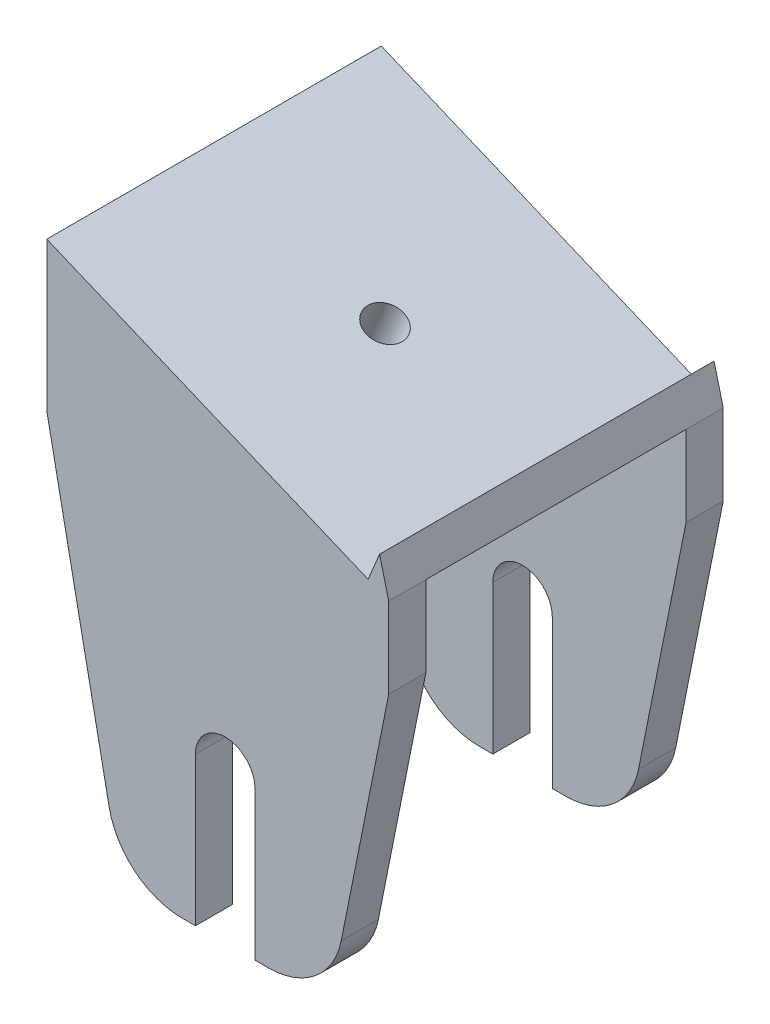
ISO-10303-21;
HEADER;
FILE_DESCRIPTION(('STEP AP214'),'2;1');
FILE_NAME('part.step','',(''),(''),'','','');
FILE_SCHEMA(('AUTOMOTIVE_DESIGN { 1 0 10303 214 1 1 1 1 }'));
ENDSEC;
DATA;
#1=APPLICATION_CONTEXT('core data for automotive mechanical design processes');
#2=APPLICATION_PROTOCOL_DEFINITION('international standard','automotive_design',2000,#1);
#3=PRODUCT_CONTEXT('',#1,'mechanical');
#4=PRODUCT('Part','Part','',(#3));
#5=PRODUCT_RELATED_PRODUCT_CATEGORY('part','',(#4));
#6=PRODUCT_DEFINITION_FORMATION('','',#4);
#7=PRODUCT_DEFINITION_CONTEXT('part definition',#1,'design');
#8=PRODUCT_DEFINITION('design','',#6,#7);
#9=PRODUCT_DEFINITION_SHAPE('','',#8);
#10=(LENGTH_UNIT() NAMED_UNIT(*) SI_UNIT(.MILLI.,.METRE.));
#11=(NAMED_UNIT(*) PLANE_ANGLE_UNIT() SI_UNIT($,.RADIAN.));
#12=(NAMED_UNIT(*) SI_UNIT($,.STERADIAN.) SOLID_ANGLE_UNIT());
#13=UNCERTAINTY_MEASURE_WITH_UNIT(LENGTH_MEASURE(1.E-05),#10,'distance_accuracy_value','');
#14=(GEOMETRIC_REPRESENTATION_CONTEXT(3) GLOBAL_UNCERTAINTY_ASSIGNED_CONTEXT((#13)) GLOBAL_UNIT_ASSIGNED_CONTEXT((#10,
#11,#12)) REPRESENTATION_CONTEXT('',''));
#15=CARTESIAN_POINT('',(0.,0.,0.));
#16=DIRECTION('',(0.,0.,1.));
#17=DIRECTION('',(1.,0.,0.));
#18=AXIS2_PLACEMENT_3D('',#15,#16,#17);
#19=CARTESIAN_POINT('',(3.16987234543207,7.45293193717279,-5.00010000000001));
#20=DIRECTION('',(-1.,0.,0.));
#21=DIRECTION('',(0.,0.,1.));
#22=AXIS2_PLACEMENT_3D('',#19,#20,#21);
#23=PLANE('',#22);
#24=DIRECTION('',(0.,-1.,0.));
#25=VECTOR('',#24,1.);
#26=CARTESIAN_POINT('',(3.16987234543207,7.45293193717279,40.));
#27=LINE('',#26,#25);
#28=CARTESIAN_POINT('',(3.16987234543207,18.2863736038394,40.));
#29=VERTEX_POINT('',#28);
#30=CARTESIAN_POINT('',(3.16987234543207,7.45293193717279,40.));
#31=VERTEX_POINT('',#30);
#32=EDGE_CURVE('E263',#29,#31,#27,.T.);
#33=ORIENTED_EDGE('',*,*,#32,.F.);
#34=DIRECTION('',(0.,0.,-1.));
#35=VECTOR('',#34,1.);
#36=CARTESIAN_POINT('',(3.16987234543207,18.2863736038394,0.));
#37=LINE('',#36,#35);
#38=CARTESIAN_POINT('',(3.16987234543207,18.2863736038394,45.));
#39=VERTEX_POINT('',#38);
#40=EDGE_CURVE('E283',#39,#29,#37,.T.);
#41=ORIENTED_EDGE('',*,*,#40,.F.);
#42=DIRECTION('',(0.,-1.,0.));
#43=VECTOR('',#42,1.);
#44=CARTESIAN_POINT('',(3.16987234543207,7.45293193717279,45.));
#45=LINE('',#44,#43);
#46=CARTESIAN_POINT('',(3.16987234543207,7.45293193717279,45.));
#47=VERTEX_POINT('',#46);
#48=EDGE_CURVE('E279',#39,#47,#45,.T.);
#49=ORIENTED_EDGE('',*,*,#48,.T.);
#50=DIRECTION('',(0.,0.,1.));
#51=VECTOR('',#50,1.);
#52=CARTESIAN_POINT('',(3.16987234543207,7.45293193717278,45.));
#53=LINE('',#52,#51);
#54=EDGE_CURVE('E299',#31,#47,#53,.T.);
#55=ORIENTED_EDGE('',*,*,#54,.F.);
#56=EDGE_LOOP('',(#33,#41,#49,#55));
#57=FACE_BOUND('',#56,.T.);
#58=ADVANCED_FACE('F33',(#57),#23,.F.);
#59=CARTESIAN_POINT('',(-24.6320886273824,-22.5470680628272,45.));
#60=DIRECTION('',(0.,0.,-1.));
#61=DIRECTION('',(-1.,0.,0.));
#62=AXIS2_PLACEMENT_3D('',#59,#60,#61);
#63=CYLINDRICAL_SURFACE('',#62,10.);
#64=CARTESIAN_POINT('',(-24.6320886273824,-22.5470680628272,40.));
#65=DIRECTION('',(0.,0.,-1.));
#66=DIRECTION('',(-1.,0.,0.));
#67=AXIS2_PLACEMENT_3D('',#64,#65,#66);
#68=CIRCLE('',#67,10.);
#69=CARTESIAN_POINT('',(-24.6320886273823,-32.5470680628272,40.));
#70=VERTEX_POINT('',#69);
#71=CARTESIAN_POINT('',(-34.4378953842916,-24.508229414209,40.));
#72=VERTEX_POINT('',#71);
#73=EDGE_CURVE('E319',#70,#72,#68,.T.);
#74=ORIENTED_EDGE('',*,*,#73,.F.);
#75=DIRECTION('',(0.,0.,-1.));
#76=VECTOR('',#75,1.);
#77=CARTESIAN_POINT('',(-24.6320886273823,-32.5470680628272,45.));
#78=LINE('',#77,#76);
#79=CARTESIAN_POINT('',(-24.6320886273823,-32.5470680628272,45.));
#80=VERTEX_POINT('',#79);
#81=EDGE_CURVE('E430',#80,#70,#78,.T.);
#82=ORIENTED_EDGE('',*,*,#81,.F.);
#83=CARTESIAN_POINT('',(-24.6320886273824,-22.5470680628272,45.));
#84=DIRECTION('',(0.,0.,1.));
#85=DIRECTION('',(1.,0.,0.));
#86=AXIS2_PLACEMENT_3D('',#83,#84,#85);
#87=CIRCLE('',#86,10.);
#88=CARTESIAN_POINT('',(-34.4378953842916,-24.508229414209,45.));
#89=VERTEX_POINT('',#88);
#90=EDGE_CURVE('E347',#89,#80,#87,.T.);
#91=ORIENTED_EDGE('',*,*,#90,.F.);
#92=DIRECTION('',(0.,0.,-1.));
#93=VECTOR('',#92,1.);
#94=CARTESIAN_POINT('',(-34.4378953842916,-24.508229414209,45.));
#95=LINE('',#94,#93);
#96=EDGE_CURVE('E398',#89,#72,#95,.T.);
#97=ORIENTED_EDGE('',*,*,#96,.T.);
#98=EDGE_LOOP('',(#74,#82,#91,#97));
#99=FACE_BOUND('',#98,.T.);
#100=ADVANCED_FACE('F502',(#99),#63,.T.);
#101=CARTESIAN_POINT('',(-22.8301276545679,-32.5470680628272,45.));
#102=DIRECTION('',(0.,1.,0.));
#103=DIRECTION('',(0.,0.,1.));
#104=AXIS2_PLACEMENT_3D('',#101,#102,#103);
#105=PLANE('',#104);
#106=DIRECTION('',(-1.,0.,0.));
#107=VECTOR('',#106,1.);
#108=CARTESIAN_POINT('',(12.1698723454321,-32.5470680628272,40.));
#109=LINE('',#108,#107);
#110=CARTESIAN_POINT('',(-22.8301276545679,-32.5470680628272,40.));
#111=VERTEX_POINT('',#110);
#112=EDGE_CURVE('E313',#111,#70,#109,.T.);
#113=ORIENTED_EDGE('',*,*,#112,.F.);
#114=DIRECTION('',(0.,0.,-1.));
#115=VECTOR('',#114,1.);
#116=CARTESIAN_POINT('',(-22.8301276545679,-32.5470680628272,45.));
#117=LINE('',#116,#115);
#118=CARTESIAN_POINT('',(-22.8301276545679,-32.5470680628272,45.));
#119=VERTEX_POINT('',#118);
#120=EDGE_CURVE('E426',#119,#111,#117,.T.);
#121=ORIENTED_EDGE('',*,*,#120,.F.);
#122=DIRECTION('',(1.,0.,0.));
#123=VECTOR('',#122,1.);
#124=CARTESIAN_POINT('',(-22.8301276545679,-32.5470680628272,45.));
#125=LINE('',#124,#123);
#126=EDGE_CURVE('E350',#80,#119,#125,.T.);
#127=ORIENTED_EDGE('',*,*,#126,.F.);
#128=ORIENTED_EDGE('',*,*,#81,.T.);
#129=EDGE_LOOP('',(#113,#121,#127,#128));
#130=FACE_BOUND('',#129,.T.);
#131=ADVANCED_FACE('F497',(#130),#105,.F.);
#132=CARTESIAN_POINT('',(-22.8301276545679,-12.5470680628272,45.));
#133=DIRECTION('',(-1.,0.,0.));
#134=DIRECTION('',(0.,-1.,0.));
#135=AXIS2_PLACEMENT_3D('',#132,#133,#134);
#136=PLANE('',#135);
#137=DIRECTION('',(0.,-1.,0.));
#138=VECTOR('',#137,1.);
#139=CARTESIAN_POINT('',(-22.8301276545679,-12.5470680628272,40.));
#140=LINE('',#139,#138);
#141=CARTESIAN_POINT('',(-22.8301276545679,-12.5470680628272,40.));
#142=VERTEX_POINT('',#141);
#143=EDGE_CURVE('E329',#142,#111,#140,.T.);
#144=ORIENTED_EDGE('',*,*,#143,.F.);
#145=DIRECTION('',(0.,0.,-1.));
#146=VECTOR('',#145,1.);
#147=CARTESIAN_POINT('',(-22.8301276545679,-12.5470680628272,45.));
#148=LINE('',#147,#146);
#149=CARTESIAN_POINT('',(-22.8301276545679,-12.5470680628272,45.));
#150=VERTEX_POINT('',#149);
#151=EDGE_CURVE('E422',#150,#142,#148,.T.);
#152=ORIENTED_EDGE('',*,*,#151,.F.);
#153=DIRECTION('',(0.,1.,0.));
#154=VECTOR('',#153,1.);
#155=CARTESIAN_POINT('',(-22.8301276545679,-12.5470680628272,45.));
#156=LINE('',#155,#154);
#157=EDGE_CURVE('E353',#119,#150,#156,.T.);
#158=ORIENTED_EDGE('',*,*,#157,.F.);
#159=ORIENTED_EDGE('',*,*,#120,.T.);
#160=EDGE_LOOP('',(#144,#152,#158,#159));
#161=FACE_BOUND('',#160,.T.);
#162=ADVANCED_FACE('F493',(#161),#136,.F.);
#163=CARTESIAN_POINT('',(-18.8301276545679,-12.5470680628272,45.));
#164=DIRECTION('',(0.,0.,-1.));
#165=DIRECTION('',(-1.,0.,0.));
#166=AXIS2_PLACEMENT_3D('',#163,#164,#165);
#167=CYLINDRICAL_SURFACE('',#166,4.);
#168=CARTESIAN_POINT('',(-18.8301276545679,-12.5470680628272,40.));
#169=DIRECTION('',(0.,0.,-1.));
#170=DIRECTION('',(-1.,0.,0.));
#171=AXIS2_PLACEMENT_3D('',#168,#169,#170);
#172=CIRCLE('',#171,4.);
#173=CARTESIAN_POINT('',(-14.8301276545679,-12.5470680628272,40.));
#174=VERTEX_POINT('',#173);
#175=EDGE_CURVE('E327',#174,#142,#172,.F.);
#176=ORIENTED_EDGE('',*,*,#175,.F.);
#177=DIRECTION('',(0.,0.,-1.));
#178=VECTOR('',#177,1.);
#179=CARTESIAN_POINT('',(-14.8301276545679,-12.5470680628272,45.));
#180=LINE('',#179,#178);
#181=CARTESIAN_POINT('',(-14.8301276545679,-12.5470680628272,45.));
#182=VERTEX_POINT('',#181);
#183=EDGE_CURVE('E418',#182,#174,#180,.T.);
#184=ORIENTED_EDGE('',*,*,#183,.F.);
#185=CARTESIAN_POINT('',(-18.8301276545679,-12.5470680628272,45.));
#186=DIRECTION('',(0.,0.,-1.));
#187=DIRECTION('',(1.,0.,0.));
#188=AXIS2_PLACEMENT_3D('',#185,#186,#187);
#189=CIRCLE('',#188,4.);
#190=EDGE_CURVE('E355',#150,#182,#189,.T.);
#191=ORIENTED_EDGE('',*,*,#190,.F.);
#192=ORIENTED_EDGE('',*,*,#151,.T.);
#193=EDGE_LOOP('',(#176,#184,#191,#192));
#194=FACE_BOUND('',#193,.T.);
#195=ADVANCED_FACE('F488',(#194),#167,.F.);
#196=CARTESIAN_POINT('',(-14.8301276545679,-12.5470680628272,45.));
#197=DIRECTION('',(1.,0.,0.));
#198=DIRECTION('',(0.,1.,0.));
#199=AXIS2_PLACEMENT_3D('',#196,#197,#198);
#200=PLANE('',#199);
#201=DIRECTION('',(0.,1.,0.));
#202=VECTOR('',#201,1.);
#203=CARTESIAN_POINT('',(-14.8301276545679,-12.5470680628272,40.));
#204=LINE('',#203,#202);
#205=CARTESIAN_POINT('',(-14.8301276545679,-32.5470680628272,40.));
#206=VERTEX_POINT('',#205);
#207=EDGE_CURVE('E325',#206,#174,#204,.T.);
#208=ORIENTED_EDGE('',*,*,#207,.F.);
#209=DIRECTION('',(0.,0.,-1.));
#210=VECTOR('',#209,1.);
#211=CARTESIAN_POINT('',(-14.8301276545679,-32.5470680628272,45.));
#212=LINE('',#211,#210);
#213=CARTESIAN_POINT('',(-14.8301276545679,-32.5470680628272,45.));
#214=VERTEX_POINT('',#213);
#215=EDGE_CURVE('E414',#214,#206,#212,.T.);
#216=ORIENTED_EDGE('',*,*,#215,.F.);
#217=DIRECTION('',(0.,-1.,0.));
#218=VECTOR('',#217,1.);
#219=CARTESIAN_POINT('',(-14.8301276545679,-12.5470680628272,45.));
#220=LINE('',#219,#218);
#221=EDGE_CURVE('E357',#182,#214,#220,.T.);
#222=ORIENTED_EDGE('',*,*,#221,.F.);
#223=ORIENTED_EDGE('',*,*,#183,.T.);
#224=EDGE_LOOP('',(#208,#216,#222,#223));
#225=FACE_BOUND('',#224,.T.);
#226=ADVANCED_FACE('F483',(#225),#200,.F.);
#227=CARTESIAN_POINT('',(-14.8301276545679,-32.5470680628272,45.));
#228=DIRECTION('',(0.,1.,0.));
#229=DIRECTION('',(0.,0.,1.));
#230=AXIS2_PLACEMENT_3D('',#227,#228,#229);
#231=PLANE('',#230);
#232=CARTESIAN_POINT('',(-13.0281666817535,-32.5470680628272,40.));
#233=VERTEX_POINT('',#232);
#234=EDGE_CURVE('E315',#233,#206,#109,.T.);
#235=ORIENTED_EDGE('',*,*,#234,.F.);
#236=DIRECTION('',(0.,0.,-1.));
#237=VECTOR('',#236,1.);
#238=CARTESIAN_POINT('',(-13.0281666817535,-32.5470680628272,45.));
#239=LINE('',#238,#237);
#240=CARTESIAN_POINT('',(-13.0281666817535,-32.5470680628272,45.));
#241=VERTEX_POINT('',#240);
#242=EDGE_CURVE('E410',#241,#233,#239,.T.);
#243=ORIENTED_EDGE('',*,*,#242,.F.);
#244=DIRECTION('',(1.,0.,0.));
#245=VECTOR('',#244,1.);
#246=CARTESIAN_POINT('',(-14.8301276545679,-32.5470680628272,45.));
#247=LINE('',#246,#245);
#248=EDGE_CURVE('E359',#214,#241,#247,.T.);
#249=ORIENTED_EDGE('',*,*,#248,.F.);
#250=ORIENTED_EDGE('',*,*,#215,.T.);
#251=EDGE_LOOP('',(#235,#243,#249,#250));
#252=FACE_BOUND('',#251,.T.);
#253=ADVANCED_FACE('F478',(#252),#231,.F.);
#254=CARTESIAN_POINT('',(-13.0281666817535,-22.5470680628272,45.));
#255=DIRECTION('',(0.,0.,-1.));
#256=DIRECTION('',(-1.,0.,0.));
#257=AXIS2_PLACEMENT_3D('',#254,#255,#256);
#258=CYLINDRICAL_SURFACE('',#257,10.);
#259=CARTESIAN_POINT('',(-13.0281666817535,-22.5470680628272,40.));
#260=DIRECTION('',(0.,0.,-1.));
#261=DIRECTION('',(-1.,0.,0.));
#262=AXIS2_PLACEMENT_3D('',#259,#260,#261);
#263=CIRCLE('',#262,10.);
#264=CARTESIAN_POINT('',(-3.22235992484428,-24.508229414209,40.));
#265=VERTEX_POINT('',#264);
#266=EDGE_CURVE('E323',#265,#233,#263,.T.);
#267=ORIENTED_EDGE('',*,*,#266,.F.);
#268=DIRECTION('',(0.,0.,-1.));
#269=VECTOR('',#268,1.);
#270=CARTESIAN_POINT('',(-3.22235992484428,-24.508229414209,45.));
#271=LINE('',#270,#269);
#272=CARTESIAN_POINT('',(-3.22235992484428,-24.508229414209,45.));
#273=VERTEX_POINT('',#272);
#274=EDGE_CURVE('E406',#273,#265,#271,.T.);
#275=ORIENTED_EDGE('',*,*,#274,.F.);
#276=CARTESIAN_POINT('',(-13.0281666817535,-22.5470680628272,45.));
#277=DIRECTION('',(0.,0.,1.));
#278=DIRECTION('',(-1.,0.,0.));
#279=AXIS2_PLACEMENT_3D('',#276,#277,#278);
#280=CIRCLE('',#279,10.);
#281=EDGE_CURVE('E361',#241,#273,#280,.T.);
#282=ORIENTED_EDGE('',*,*,#281,.F.);
#283=ORIENTED_EDGE('',*,*,#242,.T.);
#284=EDGE_LOOP('',(#267,#275,#282,#283));
#285=FACE_BOUND('',#284,.T.);
#286=ADVANCED_FACE('F474',(#285),#258,.T.);
#287=CARTESIAN_POINT('',(-3.22235992484428,-24.508229414209,45.));
#288=DIRECTION('',(-0.98058067569092,0.196116135138184,0.));
#289=DIRECTION('',(-0.196116135138184,-0.98058067569092,0.));
#290=AXIS2_PLACEMENT_3D('',#287,#288,#289);
#291=PLANE('',#290);
#292=DIRECTION('',(-0.196116135138184,-0.98058067569092,0.));
#293=VECTOR('',#292,1.);
#294=CARTESIAN_POINT('',(-3.22235992484428,-24.508229414209,40.));
#295=LINE('',#294,#293);
#296=EDGE_CURVE('E321',#31,#265,#295,.T.);
#297=ORIENTED_EDGE('',*,*,#296,.F.);
#298=ORIENTED_EDGE('',*,*,#54,.T.);
#299=DIRECTION('',(0.196116135138184,0.98058067569092,0.));
#300=VECTOR('',#299,1.);
#301=CARTESIAN_POINT('',(-3.22235992484428,-24.508229414209,45.));
#302=LINE('',#301,#300);
#303=EDGE_CURVE('E363',#273,#47,#302,.T.);
#304=ORIENTED_EDGE('',*,*,#303,.F.);
#305=ORIENTED_EDGE('',*,*,#274,.T.);
#306=EDGE_LOOP('',(#297,#298,#304,#305));
#307=FACE_BOUND('',#306,.T.);
#308=ADVANCED_FACE('F470',(#307),#291,.F.);
#309=CARTESIAN_POINT('',(-34.4378953842916,-24.508229414209,45.));
#310=DIRECTION('',(0.98058067569092,0.196116135138184,0.));
#311=DIRECTION('',(-0.196116135138184,0.98058067569092,0.));
#312=AXIS2_PLACEMENT_3D('',#309,#310,#311);
#313=PLANE('',#312);
#314=DIRECTION('',(-0.196116135138184,0.98058067569092,0.));
#315=VECTOR('',#314,1.);
#316=CARTESIAN_POINT('',(-34.4378953842916,-24.508229414209,40.));
#317=LINE('',#316,#315);
#318=CARTESIAN_POINT('',(-42.8301276545679,17.4529319371728,40.));
#319=VERTEX_POINT('',#318);
#320=EDGE_CURVE('E433',#72,#319,#317,.T.);
#321=ORIENTED_EDGE('',*,*,#320,.F.);
#322=ORIENTED_EDGE('',*,*,#96,.F.);
#323=DIRECTION('',(0.196116135138184,-0.98058067569092,0.));
#324=VECTOR('',#323,1.);
#325=CARTESIAN_POINT('',(-34.4378953842916,-24.508229414209,45.));
#326=LINE('',#325,#324);
#327=CARTESIAN_POINT('',(-42.8301276545679,17.4529319371728,45.));
#328=VERTEX_POINT('',#327);
#329=EDGE_CURVE('E368',#328,#89,#326,.T.);
#330=ORIENTED_EDGE('',*,*,#329,.F.);
#331=DIRECTION('',(0.,0.,-1.));
#332=VECTOR('',#331,1.);
#333=CARTESIAN_POINT('',(-42.8301276545679,17.4529319371728,45.));
#334=LINE('',#333,#332);
#335=EDGE_CURVE('E402',#328,#319,#334,.T.);
#336=ORIENTED_EDGE('',*,*,#335,.T.);
#337=EDGE_LOOP('',(#321,#322,#330,#336));
#338=FACE_BOUND('',#337,.T.);
#339=ADVANCED_FACE('F507',(#338),#313,.F.);
#340=CARTESIAN_POINT('',(-24.6320886273824,-22.5470680628272,45.));
#341=DIRECTION('',(0.,0.,1.));
#342=DIRECTION('',(1.,0.,0.));
#343=AXIS2_PLACEMENT_3D('',#340,#341,#342);
#344=PLANE('',#343);
#345=ORIENTED_EDGE('',*,*,#48,.F.);
#346=DIRECTION('',(-0.246153846153847,0.969230769230769,0.));
#347=VECTOR('',#346,1.);
#348=CARTESIAN_POINT('',(1.93910311466284,23.1325274499933,45.));
#349=LINE('',#348,#347);
#350=CARTESIAN_POINT('',(1.93910311466284,23.1325274499933,45.));
#351=VERTEX_POINT('',#350);
#352=EDGE_CURVE('E257',#39,#351,#349,.T.);
#353=ORIENTED_EDGE('',*,*,#352,.T.);
#354=DIRECTION('',(-0.384615384615384,-0.923076923076923,0.));
#355=VECTOR('',#354,1.);
#356=CARTESIAN_POINT('',(0.400641576201298,19.4402197576856,45.));
#357=LINE('',#356,#355);
#358=CARTESIAN_POINT('',(0.400641576201295,19.4402197576856,45.));
#359=VERTEX_POINT('',#358);
#360=EDGE_CURVE('E234',#351,#359,#357,.T.);
#361=ORIENTED_EDGE('',*,*,#360,.T.);
#362=DIRECTION('',(0.923076923076923,-0.384615384615385,0.));
#363=VECTOR('',#362,1.);
#364=CARTESIAN_POINT('',(5.16991080697052,17.4530242448651,45.));
#365=LINE('',#364,#363);
#366=CARTESIAN_POINT('',(-42.8300891930295,37.4530242448651,45.));
#367=VERTEX_POINT('',#366);
#368=EDGE_CURVE('E48',#367,#359,#365,.T.);
#369=ORIENTED_EDGE('',*,*,#368,.F.);
#370=DIRECTION('',(0.384615384615384,0.923076923076923,0.));
#371=VECTOR('',#370,1.);
#372=CARTESIAN_POINT('',(-46.6762815007218,28.2221627064035,45.));
#373=LINE('',#372,#371);
#374=CARTESIAN_POINT('',(-42.8301276545679,37.4529319371728,45.));
#375=VERTEX_POINT('',#374);
#376=EDGE_CURVE('E297',#375,#367,#373,.T.);
#377=ORIENTED_EDGE('',*,*,#376,.F.);
#378=DIRECTION('',(0.,-1.,0.));
#379=VECTOR('',#378,1.);
#380=CARTESIAN_POINT('',(-42.8301276545679,37.4529319371728,45.));
#381=LINE('',#380,#379);
#382=EDGE_CURVE('E366',#375,#328,#381,.T.);
#383=ORIENTED_EDGE('',*,*,#382,.T.);
#384=ORIENTED_EDGE('',*,*,#329,.T.);
#385=ORIENTED_EDGE('',*,*,#90,.T.);
#386=ORIENTED_EDGE('',*,*,#126,.T.);
#387=ORIENTED_EDGE('',*,*,#157,.T.);
#388=ORIENTED_EDGE('',*,*,#190,.T.);
#389=ORIENTED_EDGE('',*,*,#221,.T.);
#390=ORIENTED_EDGE('',*,*,#248,.T.);
#391=ORIENTED_EDGE('',*,*,#281,.T.);
#392=ORIENTED_EDGE('',*,*,#303,.T.);
#393=EDGE_LOOP('',(#345,#353,#361,#369,#377,#383,#384,#385,#386,#387,#388,#389,#390,#391,#392));
#394=FACE_BOUND('',#393,.T.);
#395=ADVANCED_FACE('F464',(#394),#344,.T.);
#396=CARTESIAN_POINT('',(12.1698723454321,27.3827956073122,40.));
#397=DIRECTION('',(0.,0.,-1.));
#398=DIRECTION('',(-1.,0.,0.));
#399=AXIS2_PLACEMENT_3D('',#396,#397,#398);
#400=PLANE('',#399);
#401=DIRECTION('',(-0.923076923076923,0.384615384615384,0.));
#402=VECTOR('',#401,1.);
#403=CARTESIAN_POINT('',(3.76282015485004,7.20587034991529,40.));
#404=LINE('',#403,#402);
#405=CARTESIAN_POINT('',(-8.83012765456794,12.4529319371728,40.));
#406=VERTEX_POINT('',#405);
#407=CARTESIAN_POINT('',(-42.8301276545679,26.6195986038394,40.));
#408=VERTEX_POINT('',#407);
#409=EDGE_CURVE('E437',#406,#408,#404,.T.);
#410=ORIENTED_EDGE('',*,*,#409,.F.);
#411=DIRECTION('',(1.,0.,0.));
#412=VECTOR('',#411,1.);
#413=CARTESIAN_POINT('',(-46.8301276545679,12.4529319371728,40.));
#414=LINE('',#413,#412);
#415=CARTESIAN_POINT('',(-6.83012765456793,12.4529319371728,40.));
#416=VERTEX_POINT('',#415);
#417=EDGE_CURVE('E266',#406,#416,#414,.T.);
#418=ORIENTED_EDGE('',*,*,#417,.T.);
#419=CARTESIAN_POINT('',(-6.83012765456793,22.4529319371728,40.));
#420=DIRECTION('',(0.,0.,-1.));
#421=DIRECTION('',(-1.,0.,0.));
#422=AXIS2_PLACEMENT_3D('',#419,#420,#421);
#423=CIRCLE('',#422,10.);
#424=CARTESIAN_POINT('',(2.40068003727822,18.6068703989035,40.));
#425=VERTEX_POINT('',#424);
#426=EDGE_CURVE('E41',#416,#425,#423,.F.);
#427=ORIENTED_EDGE('',*,*,#426,.T.);
#428=DIRECTION('',(-0.923076923076923,0.384615384615384,0.));
#429=VECTOR('',#428,1.);
#430=CARTESIAN_POINT('',(7.60901246254235,16.4367318883768,40.));
#431=LINE('',#430,#429);
#432=EDGE_CURVE('E448',#29,#425,#431,.T.);
#433=ORIENTED_EDGE('',*,*,#432,.F.);
#434=ORIENTED_EDGE('',*,*,#32,.T.);
#435=ORIENTED_EDGE('',*,*,#296,.T.);
#436=ORIENTED_EDGE('',*,*,#266,.T.);
#437=ORIENTED_EDGE('',*,*,#234,.T.);
#438=ORIENTED_EDGE('',*,*,#207,.T.);
#439=ORIENTED_EDGE('',*,*,#175,.T.);
#440=ORIENTED_EDGE('',*,*,#143,.T.);
#441=ORIENTED_EDGE('',*,*,#112,.T.);
#442=ORIENTED_EDGE('',*,*,#73,.T.);
#443=ORIENTED_EDGE('',*,*,#320,.T.);
#444=DIRECTION('',(0.,1.,0.));
#445=VECTOR('',#444,1.);
#446=CARTESIAN_POINT('',(-42.8301276545679,37.4529319371728,40.));
#447=LINE('',#446,#445);
#448=EDGE_CURVE('E316',#319,#408,#447,.T.);
#449=ORIENTED_EDGE('',*,*,#448,.T.);
#450=EDGE_LOOP('',(#410,#418,#427,#433,#434,#435,#436,#437,#438,#439,#440,#441,#442,#443,#449));
#451=FACE_BOUND('',#450,.T.);
#452=ADVANCED_FACE('F454',(#451),#400,.T.);
#453=CARTESIAN_POINT('',(-46.6762815007218,28.2221627064035,45.));
#454=DIRECTION('',(-0.923076923076923,0.384615384615384,0.));
#455=DIRECTION('',(-0.384615384615384,-0.923076923076923,0.));
#456=AXIS2_PLACEMENT_3D('',#453,#454,#455);
#457=PLANE('',#456);
#458=DIRECTION('',(0.,0.,-1.));
#459=VECTOR('',#458,1.);
#460=CARTESIAN_POINT('',(-42.8301276545679,37.4529319371728,45.));
#461=LINE('',#460,#459);
#462=CARTESIAN_POINT('',(-42.8301276545679,37.4529319371728,0.));
#463=VERTEX_POINT('',#462);
#464=EDGE_CURVE('E289',#375,#463,#461,.T.);
#465=ORIENTED_EDGE('',*,*,#464,.F.);
#466=ORIENTED_EDGE('',*,*,#376,.T.);
#467=DIRECTION('',(0.,0.,1.));
#468=VECTOR('',#467,1.);
#469=CARTESIAN_POINT('',(-42.8300891930295,37.4530242448651,45.));
#470=LINE('',#469,#468);
#471=CARTESIAN_POINT('',(-42.8300891930295,37.4530242448651,0.));
#472=VERTEX_POINT('',#471);
#473=EDGE_CURVE('E294',#472,#367,#470,.T.);
#474=ORIENTED_EDGE('',*,*,#473,.F.);
#475=DIRECTION('',(0.384615384615384,0.923076923076923,0.));
#476=VECTOR('',#475,1.);
#477=CARTESIAN_POINT('',(-46.6762815007218,28.2221627064035,0.));
#478=LINE('',#477,#476);
#479=EDGE_CURVE('E296',#463,#472,#478,.T.);
#480=ORIENTED_EDGE('',*,*,#479,.F.);
#481=EDGE_LOOP('',(#465,#466,#474,#480));
#482=FACE_BOUND('',#481,.T.);
#483=ADVANCED_FACE('F596',(#482),#457,.T.);
#484=CARTESIAN_POINT('',(3.114927366072,7.47582567857281,0.));
#485=DIRECTION('',(-0.384615384615385,-0.923076923076923,0.));
#486=DIRECTION('',(0.923076923076923,-0.384615384615384,0.));
#487=AXIS2_PLACEMENT_3D('',#484,#485,#486);
#488=PLANE('',#487);
#489=DIRECTION('',(0.,0.,-1.));
#490=VECTOR('',#489,1.);
#491=CARTESIAN_POINT('',(-8.83012765456794,12.4529319371728,0.));
#492=LINE('',#491,#490);
#493=CARTESIAN_POINT('',(-8.83012765456794,12.4529319371728,5.));
#494=VERTEX_POINT('',#493);
#495=EDGE_CURVE('E269',#406,#494,#492,.T.);
#496=ORIENTED_EDGE('',*,*,#495,.F.);
#497=ORIENTED_EDGE('',*,*,#409,.T.);
#498=DIRECTION('',(0.,0.,1.));
#499=VECTOR('',#498,1.);
#500=CARTESIAN_POINT('',(-42.8301276545679,26.6195986038394,0.));
#501=LINE('',#500,#499);
#502=CARTESIAN_POINT('',(-42.8301276545679,26.6195986038394,5.));
#503=VERTEX_POINT('',#502);
#504=EDGE_CURVE('E286',#503,#408,#501,.T.);
#505=ORIENTED_EDGE('',*,*,#504,.F.);
#506=DIRECTION('',(0.923076923076923,-0.384615384615384,0.));
#507=VECTOR('',#506,1.);
#508=CARTESIAN_POINT('',(9.31542751955514,4.89228394795483,5.));
#509=LINE('',#508,#507);
#510=EDGE_CURVE('E303',#503,#494,#509,.T.);
#511=ORIENTED_EDGE('',*,*,#510,.T.);
#512=EDGE_LOOP('',(#496,#497,#505,#511));
#513=FACE_BOUND('',#512,.T.);
#514=CARTESIAN_POINT('',(-23.676300731491,18.6388373858907,22.5));
#515=DIRECTION('',(-0.384615384615385,-0.923076923076923,0.));
#516=DIRECTION('',(0.923076923076923,-0.384615384615384,0.));
#517=AXIS2_PLACEMENT_3D('',#514,#515,#516);
#518=CIRCLE('',#517,2.5);
#519=CARTESIAN_POINT('',(-21.3686084237987,17.6772989243523,22.5));
#520=VERTEX_POINT('',#519);
#521=EDGE_CURVE('E276',#520,#520,#518,.T.);
#522=ORIENTED_EDGE('',*,*,#521,.F.);
#523=EDGE_LOOP('',(#522));
#524=FACE_BOUND('',#523,.T.);
#525=ADVANCED_FACE('F517',(#513,#524),#488,.T.);
#526=CARTESIAN_POINT('',(6.96111967376431,16.7066872170343,0.));
#527=DIRECTION('',(-0.384615384615385,-0.923076923076923,0.));
#528=DIRECTION('',(0.923076923076923,-0.384615384615384,0.));
#529=AXIS2_PLACEMENT_3D('',#526,#527,#528);
#530=PLANE('',#529);
#531=ORIENTED_EDGE('',*,*,#368,.T.);
#532=DIRECTION('',(0.,0.,1.));
#533=VECTOR('',#532,1.);
#534=CARTESIAN_POINT('',(0.400641576201298,19.4402197576856,0.));
#535=LINE('',#534,#533);
#536=CARTESIAN_POINT('',(0.400641576201294,19.4402197576856,0.));
#537=VERTEX_POINT('',#536);
#538=EDGE_CURVE('E52',#537,#359,#535,.T.);
#539=ORIENTED_EDGE('',*,*,#538,.F.);
#540=DIRECTION('',(-0.923076923076923,0.384615384615384,0.));
#541=VECTOR('',#540,1.);
#542=CARTESIAN_POINT('',(5.16991080697052,17.4530242448651,0.));
#543=LINE('',#542,#541);
#544=EDGE_CURVE('E252',#537,#472,#543,.T.);
#545=ORIENTED_EDGE('',*,*,#544,.T.);
#546=ORIENTED_EDGE('',*,*,#473,.T.);
#547=EDGE_LOOP('',(#531,#539,#545,#546));
#548=FACE_BOUND('',#547,.T.);
#549=CARTESIAN_POINT('',(-19.8301084237987,27.8696989243523,22.5));
#550=DIRECTION('',(0.384615384615385,0.923076923076923,0.));
#551=DIRECTION('',(-0.923076923076923,0.384615384615385,0.));
#552=AXIS2_PLACEMENT_3D('',#549,#550,#551);
#553=CIRCLE('',#552,2.5);
#554=CARTESIAN_POINT('',(-22.137800731491,28.8312373858907,22.5));
#555=VERTEX_POINT('',#554);
#556=EDGE_CURVE('E273',#555,#555,#553,.T.);
#557=ORIENTED_EDGE('',*,*,#556,.F.);
#558=EDGE_LOOP('',(#557));
#559=FACE_BOUND('',#558,.T.);
#560=ADVANCED_FACE('F597',(#548,#559),#530,.F.);
#561=CARTESIAN_POINT('',(-24.6320886273824,-22.5470680628272,0.));
#562=DIRECTION('',(0.,0.,1.));
#563=DIRECTION('',(1.,0.,0.));
#564=AXIS2_PLACEMENT_3D('',#561,#562,#563);
#565=PLANE('',#564);
#566=ORIENTED_EDGE('',*,*,#544,.F.);
#567=DIRECTION('',(-0.384615384615384,-0.923076923076923,0.));
#568=VECTOR('',#567,1.);
#569=CARTESIAN_POINT('',(0.400641576201298,19.4402197576856,0.));
#570=LINE('',#569,#568);
#571=CARTESIAN_POINT('',(1.93910311466284,23.1325274499933,0.));
#572=VERTEX_POINT('',#571);
#573=EDGE_CURVE('E232',#572,#537,#570,.T.);
#574=ORIENTED_EDGE('',*,*,#573,.F.);
#575=DIRECTION('',(-0.246153846153847,0.969230769230769,0.));
#576=VECTOR('',#575,1.);
#577=CARTESIAN_POINT('',(1.93910311466284,23.1325274499933,0.));
#578=LINE('',#577,#576);
#579=CARTESIAN_POINT('',(3.16987234543207,18.2863736038394,0.));
#580=VERTEX_POINT('',#579);
#581=EDGE_CURVE('E242',#580,#572,#578,.T.);
#582=ORIENTED_EDGE('',*,*,#581,.F.);
#583=DIRECTION('',(0.,-1.,0.));
#584=VECTOR('',#583,1.);
#585=CARTESIAN_POINT('',(3.16987234543207,-22.5470680628272,0.));
#586=LINE('',#585,#584);
#587=CARTESIAN_POINT('',(3.16987234543207,7.45293193717279,0.));
#588=VERTEX_POINT('',#587);
#589=EDGE_CURVE('E281',#580,#588,#586,.T.);
#590=ORIENTED_EDGE('',*,*,#589,.T.);
#591=DIRECTION('',(0.196116135138184,0.98058067569092,0.));
#592=VECTOR('',#591,1.);
#593=CARTESIAN_POINT('',(-3.22235992484428,-24.508229414209,0.));
#594=LINE('',#593,#592);
#595=CARTESIAN_POINT('',(-3.22235992484428,-24.508229414209,0.));
#596=VERTEX_POINT('',#595);
#597=EDGE_CURVE('E391',#596,#588,#594,.T.);
#598=ORIENTED_EDGE('',*,*,#597,.F.);
#599=CARTESIAN_POINT('',(-13.0281666817535,-22.5470680628272,0.));
#600=DIRECTION('',(0.,0.,1.));
#601=DIRECTION('',(-1.,0.,0.));
#602=AXIS2_PLACEMENT_3D('',#599,#600,#601);
#603=CIRCLE('',#602,10.);
#604=CARTESIAN_POINT('',(-13.0281666817535,-32.5470680628272,0.));
#605=VERTEX_POINT('',#604);
#606=EDGE_CURVE('E388',#605,#596,#603,.T.);
#607=ORIENTED_EDGE('',*,*,#606,.F.);
#608=DIRECTION('',(1.,0.,0.));
#609=VECTOR('',#608,1.);
#610=CARTESIAN_POINT('',(-14.8301276545679,-32.5470680628272,0.));
#611=LINE('',#610,#609);
#612=CARTESIAN_POINT('',(-14.8301276545679,-32.5470680628272,0.));
#613=VERTEX_POINT('',#612);
#614=EDGE_CURVE('E385',#613,#605,#611,.T.);
#615=ORIENTED_EDGE('',*,*,#614,.F.);
#616=DIRECTION('',(0.,-1.,0.));
#617=VECTOR('',#616,1.);
#618=CARTESIAN_POINT('',(-14.8301276545679,-12.5470680628272,0.));
#619=LINE('',#618,#617);
#620=CARTESIAN_POINT('',(-14.8301276545679,-12.5470680628272,0.));
#621=VERTEX_POINT('',#620);
#622=EDGE_CURVE('E382',#621,#613,#619,.T.);
#623=ORIENTED_EDGE('',*,*,#622,.F.);
#624=CARTESIAN_POINT('',(-18.8301276545679,-12.5470680628272,0.));
#625=DIRECTION('',(0.,0.,-1.));
#626=DIRECTION('',(1.,0.,0.));
#627=AXIS2_PLACEMENT_3D('',#624,#625,#626);
#628=CIRCLE('',#627,4.);
#629=CARTESIAN_POINT('',(-22.8301276545679,-12.5470680628272,0.));
#630=VERTEX_POINT('',#629);
#631=EDGE_CURVE('E379',#630,#621,#628,.T.);
#632=ORIENTED_EDGE('',*,*,#631,.F.);
#633=DIRECTION('',(0.,1.,0.));
#634=VECTOR('',#633,1.);
#635=CARTESIAN_POINT('',(-22.8301276545679,-12.5470680628272,0.));
#636=LINE('',#635,#634);
#637=CARTESIAN_POINT('',(-22.8301276545679,-32.5470680628272,0.));
#638=VERTEX_POINT('',#637);
#639=EDGE_CURVE('E376',#638,#630,#636,.T.);
#640=ORIENTED_EDGE('',*,*,#639,.F.);
#641=DIRECTION('',(1.,0.,0.));
#642=VECTOR('',#641,1.);
#643=CARTESIAN_POINT('',(-22.8301276545679,-32.5470680628272,0.));
#644=LINE('',#643,#642);
#645=CARTESIAN_POINT('',(-24.6320886273823,-32.5470680628272,0.));
#646=VERTEX_POINT('',#645);
#647=EDGE_CURVE('E373',#646,#638,#644,.T.);
#648=ORIENTED_EDGE('',*,*,#647,.F.);
#649=CARTESIAN_POINT('',(-24.6320886273824,-22.5470680628272,0.));
#650=DIRECTION('',(0.,0.,1.));
#651=DIRECTION('',(1.,0.,0.));
#652=AXIS2_PLACEMENT_3D('',#649,#650,#651);
#653=CIRCLE('',#652,10.);
#654=CARTESIAN_POINT('',(-34.4378953842916,-24.508229414209,0.));
#655=VERTEX_POINT('',#654);
#656=EDGE_CURVE('E346',#655,#646,#653,.T.);
#657=ORIENTED_EDGE('',*,*,#656,.F.);
#658=DIRECTION('',(0.196116135138184,-0.98058067569092,0.));
#659=VECTOR('',#658,1.);
#660=CARTESIAN_POINT('',(-34.4378953842916,-24.508229414209,0.));
#661=LINE('',#660,#659);
#662=CARTESIAN_POINT('',(-42.8301276545679,17.4529319371728,0.));
#663=VERTEX_POINT('',#662);
#664=EDGE_CURVE('E351',#663,#655,#661,.T.);
#665=ORIENTED_EDGE('',*,*,#664,.F.);
#666=DIRECTION('',(0.,-1.,0.));
#667=VECTOR('',#666,1.);
#668=CARTESIAN_POINT('',(-42.8301276545679,37.4529319371728,0.));
#669=LINE('',#668,#667);
#670=EDGE_CURVE('E394',#463,#663,#669,.T.);
#671=ORIENTED_EDGE('',*,*,#670,.F.);
#672=ORIENTED_EDGE('',*,*,#479,.T.);
#673=EDGE_LOOP('',(#566,#574,#582,#590,#598,#607,#615,#623,#632,#640,#648,#657,#665,#671,#672));
#674=FACE_BOUND('',#673,.T.);
#675=ADVANCED_FACE('F250',(#674),#565,.F.);
#676=CARTESIAN_POINT('',(-13.0281666817535,-22.5470680628272,5.));
#677=DIRECTION('',(0.,0.,1.));
#678=DIRECTION('',(0.,-1.,0.));
#679=AXIS2_PLACEMENT_3D('',#676,#677,#678);
#680=CIRCLE('',#679,10.);
#681=CARTESIAN_POINT('',(-13.0281666817535,-32.5470680628272,5.));
#682=VERTEX_POINT('',#681);
#683=CARTESIAN_POINT('',(-3.22235992484428,-24.508229414209,5.));
#684=VERTEX_POINT('',#683);
#685=EDGE_CURVE('E338',#682,#684,#680,.T.);
#686=ORIENTED_EDGE('',*,*,#685,.F.);
#687=EDGE_CURVE('E409',#682,#605,#239,.T.);
#688=ORIENTED_EDGE('',*,*,#687,.T.);
#689=ORIENTED_EDGE('',*,*,#606,.T.);
#690=EDGE_CURVE('E405',#684,#596,#271,.T.);
#691=ORIENTED_EDGE('',*,*,#690,.F.);
#692=EDGE_LOOP('',(#686,#688,#689,#691));
#693=FACE_BOUND('',#692,.T.);
#694=ADVANCED_FACE('F557',(#693),#258,.T.);
#695=DIRECTION('',(-1.,0.,0.));
#696=VECTOR('',#695,1.);
#697=CARTESIAN_POINT('',(12.1698723454321,-32.5470680628272,4.99999999999999));
#698=LINE('',#697,#696);
#699=CARTESIAN_POINT('',(-14.8301276545679,-32.5470680628272,4.99999999999999));
#700=VERTEX_POINT('',#699);
#701=EDGE_CURVE('E312',#682,#700,#698,.T.);
#702=ORIENTED_EDGE('',*,*,#701,.T.);
#703=EDGE_CURVE('E413',#700,#613,#212,.T.);
#704=ORIENTED_EDGE('',*,*,#703,.T.);
#705=ORIENTED_EDGE('',*,*,#614,.T.);
#706=ORIENTED_EDGE('',*,*,#687,.F.);
#707=EDGE_LOOP('',(#702,#704,#705,#706));
#708=FACE_BOUND('',#707,.T.);
#709=ADVANCED_FACE('F564',(#708),#231,.F.);
#710=DIRECTION('',(0.,-1.,0.));
#711=VECTOR('',#710,1.);
#712=CARTESIAN_POINT('',(-14.8301276545679,-12.5470680628272,5.));
#713=LINE('',#712,#711);
#714=CARTESIAN_POINT('',(-14.8301276545679,-12.5470680628272,5.));
#715=VERTEX_POINT('',#714);
#716=EDGE_CURVE('E340',#715,#700,#713,.T.);
#717=ORIENTED_EDGE('',*,*,#716,.F.);
#718=EDGE_CURVE('E417',#715,#621,#180,.T.);
#719=ORIENTED_EDGE('',*,*,#718,.T.);
#720=ORIENTED_EDGE('',*,*,#622,.T.);
#721=ORIENTED_EDGE('',*,*,#703,.F.);
#722=EDGE_LOOP('',(#717,#719,#720,#721));
#723=FACE_BOUND('',#722,.T.);
#724=ADVANCED_FACE('F568',(#723),#200,.F.);
#725=CARTESIAN_POINT('',(-18.8301276545679,-12.5470680628272,5.));
#726=DIRECTION('',(0.,0.,1.));
#727=DIRECTION('',(0.,-1.,0.));
#728=AXIS2_PLACEMENT_3D('',#725,#726,#727);
#729=CIRCLE('',#728,4.);
#730=CARTESIAN_POINT('',(-22.8301276545679,-12.5470680628272,5.));
#731=VERTEX_POINT('',#730);
#732=EDGE_CURVE('E342',#731,#715,#729,.F.);
#733=ORIENTED_EDGE('',*,*,#732,.F.);
#734=EDGE_CURVE('E421',#731,#630,#148,.T.);
#735=ORIENTED_EDGE('',*,*,#734,.T.);
#736=ORIENTED_EDGE('',*,*,#631,.T.);
#737=ORIENTED_EDGE('',*,*,#718,.F.);
#738=EDGE_LOOP('',(#733,#735,#736,#737));
#739=FACE_BOUND('',#738,.T.);
#740=ADVANCED_FACE('F572',(#739),#167,.F.);
#741=DIRECTION('',(0.,1.,0.));
#742=VECTOR('',#741,1.);
#743=CARTESIAN_POINT('',(-22.8301276545679,-12.5470680628272,5.));
#744=LINE('',#743,#742);
#745=CARTESIAN_POINT('',(-22.8301276545679,-32.5470680628272,4.99999999999999));
#746=VERTEX_POINT('',#745);
#747=EDGE_CURVE('E344',#746,#731,#744,.T.);
#748=ORIENTED_EDGE('',*,*,#747,.F.);
#749=EDGE_CURVE('E425',#746,#638,#117,.T.);
#750=ORIENTED_EDGE('',*,*,#749,.T.);
#751=ORIENTED_EDGE('',*,*,#639,.T.);
#752=ORIENTED_EDGE('',*,*,#734,.F.);
#753=EDGE_LOOP('',(#748,#750,#751,#752));
#754=FACE_BOUND('',#753,.T.);
#755=ADVANCED_FACE('F579',(#754),#136,.F.);
#756=CARTESIAN_POINT('',(-24.6320886273823,-32.5470680628272,4.99999999999999));
#757=VERTEX_POINT('',#756);
#758=EDGE_CURVE('E309',#746,#757,#698,.T.);
#759=ORIENTED_EDGE('',*,*,#758,.T.);
#760=EDGE_CURVE('E429',#757,#646,#78,.T.);
#761=ORIENTED_EDGE('',*,*,#760,.T.);
#762=ORIENTED_EDGE('',*,*,#647,.T.);
#763=ORIENTED_EDGE('',*,*,#749,.F.);
#764=EDGE_LOOP('',(#759,#761,#762,#763));
#765=FACE_BOUND('',#764,.T.);
#766=ADVANCED_FACE('F582',(#765),#105,.F.);
#767=CARTESIAN_POINT('',(-24.6320886273824,-22.5470680628272,5.));
#768=DIRECTION('',(0.,0.,1.));
#769=DIRECTION('',(0.,-1.,0.));
#770=AXIS2_PLACEMENT_3D('',#767,#768,#769);
#771=CIRCLE('',#770,10.);
#772=CARTESIAN_POINT('',(-34.4378953842916,-24.508229414209,5.));
#773=VERTEX_POINT('',#772);
#774=EDGE_CURVE('E333',#773,#757,#771,.T.);
#775=ORIENTED_EDGE('',*,*,#774,.F.);
#776=EDGE_CURVE('E370',#773,#655,#95,.T.);
#777=ORIENTED_EDGE('',*,*,#776,.T.);
#778=ORIENTED_EDGE('',*,*,#656,.T.);
#779=ORIENTED_EDGE('',*,*,#760,.F.);
#780=EDGE_LOOP('',(#775,#777,#778,#779));
#781=FACE_BOUND('',#780,.T.);
#782=ADVANCED_FACE('F541',(#781),#63,.T.);
#783=DIRECTION('',(0.196116135138184,-0.98058067569092,0.));
#784=VECTOR('',#783,1.);
#785=CARTESIAN_POINT('',(-34.4378953842916,-24.508229414209,5.));
#786=LINE('',#785,#784);
#787=CARTESIAN_POINT('',(-42.8301276545679,17.4529319371728,5.));
#788=VERTEX_POINT('',#787);
#789=EDGE_CURVE('E435',#788,#773,#786,.T.);
#790=ORIENTED_EDGE('',*,*,#789,.F.);
#791=EDGE_CURVE('E401',#788,#663,#334,.T.);
#792=ORIENTED_EDGE('',*,*,#791,.T.);
#793=ORIENTED_EDGE('',*,*,#664,.T.);
#794=ORIENTED_EDGE('',*,*,#776,.F.);
#795=EDGE_LOOP('',(#790,#792,#793,#794));
#796=FACE_BOUND('',#795,.T.);
#797=ADVANCED_FACE('F590',(#796),#313,.F.);
#798=CARTESIAN_POINT('',(12.1698723454321,11.7429515300595,5.));
#799=DIRECTION('',(0.,0.,1.));
#800=DIRECTION('',(0.,-1.,0.));
#801=AXIS2_PLACEMENT_3D('',#798,#799,#800);
#802=PLANE('',#801);
#803=ORIENTED_EDGE('',*,*,#789,.T.);
#804=ORIENTED_EDGE('',*,*,#774,.T.);
#805=ORIENTED_EDGE('',*,*,#758,.F.);
#806=ORIENTED_EDGE('',*,*,#747,.T.);
#807=ORIENTED_EDGE('',*,*,#732,.T.);
#808=ORIENTED_EDGE('',*,*,#716,.T.);
#809=ORIENTED_EDGE('',*,*,#701,.F.);
#810=ORIENTED_EDGE('',*,*,#685,.T.);
#811=DIRECTION('',(0.196116135138184,0.98058067569092,0.));
#812=VECTOR('',#811,1.);
#813=CARTESIAN_POINT('',(-3.22235992484428,-24.508229414209,5.));
#814=LINE('',#813,#812);
#815=CARTESIAN_POINT('',(3.16987234543207,7.45293193717278,5.));
#816=VERTEX_POINT('',#815);
#817=EDGE_CURVE('E335',#684,#816,#814,.T.);
#818=ORIENTED_EDGE('',*,*,#817,.T.);
#819=DIRECTION('',(0.,1.,0.));
#820=VECTOR('',#819,1.);
#821=CARTESIAN_POINT('',(3.16987234543207,7.45293193717278,5.));
#822=LINE('',#821,#820);
#823=CARTESIAN_POINT('',(3.16987234543207,18.2863736038394,5.));
#824=VERTEX_POINT('',#823);
#825=EDGE_CURVE('E260',#816,#824,#822,.T.);
#826=ORIENTED_EDGE('',*,*,#825,.T.);
#827=DIRECTION('',(0.923076923076923,-0.384615384615384,0.));
#828=VECTOR('',#827,1.);
#829=CARTESIAN_POINT('',(13.1616198272475,14.1231454864164,5.));
#830=LINE('',#829,#828);
#831=CARTESIAN_POINT('',(2.40068003727822,18.6068703989035,5.));
#832=VERTEX_POINT('',#831);
#833=EDGE_CURVE('E445',#832,#824,#830,.T.);
#834=ORIENTED_EDGE('',*,*,#833,.F.);
#835=CARTESIAN_POINT('',(-6.83012765456793,22.4529319371728,5.));
#836=DIRECTION('',(0.,0.,1.));
#837=DIRECTION('',(0.,-1.,0.));
#838=AXIS2_PLACEMENT_3D('',#835,#836,#837);
#839=CIRCLE('',#838,10.);
#840=CARTESIAN_POINT('',(-6.83012765456793,12.4529319371728,5.));
#841=VERTEX_POINT('',#840);
#842=EDGE_CURVE('E11',#832,#841,#839,.F.);
#843=ORIENTED_EDGE('',*,*,#842,.T.);
#844=DIRECTION('',(1.,0.,0.));
#845=VECTOR('',#844,1.);
#846=CARTESIAN_POINT('',(-46.8301276545679,12.4529319371728,5.));
#847=LINE('',#846,#845);
#848=EDGE_CURVE('E265',#494,#841,#847,.T.);
#849=ORIENTED_EDGE('',*,*,#848,.F.);
#850=ORIENTED_EDGE('',*,*,#510,.F.);
#851=DIRECTION('',(0.,-1.,0.));
#852=VECTOR('',#851,1.);
#853=CARTESIAN_POINT('',(-42.8301276545679,37.4529319371728,5.));
#854=LINE('',#853,#852);
#855=EDGE_CURVE('E331',#503,#788,#854,.T.);
#856=ORIENTED_EDGE('',*,*,#855,.T.);
#857=EDGE_LOOP('',(#803,#804,#805,#806,#807,#808,#809,#810,#818,#826,#834,#843,#849,#850,#856));
#858=FACE_BOUND('',#857,.T.);
#859=ADVANCED_FACE('F521',(#858),#802,.T.);
#860=CARTESIAN_POINT('',(-42.8301276545679,37.4529319371728,45.));
#861=DIRECTION('',(1.,0.,0.));
#862=DIRECTION('',(0.,0.,-1.));
#863=AXIS2_PLACEMENT_3D('',#860,#861,#862);
#864=PLANE('',#863);
#865=ORIENTED_EDGE('',*,*,#855,.F.);
#866=ORIENTED_EDGE('',*,*,#504,.T.);
#867=ORIENTED_EDGE('',*,*,#448,.F.);
#868=ORIENTED_EDGE('',*,*,#335,.F.);
#869=ORIENTED_EDGE('',*,*,#382,.F.);
#870=ORIENTED_EDGE('',*,*,#464,.T.);
#871=ORIENTED_EDGE('',*,*,#670,.T.);
#872=ORIENTED_EDGE('',*,*,#791,.F.);
#873=EDGE_LOOP('',(#865,#866,#867,#868,#869,#870,#871,#872));
#874=FACE_BOUND('',#873,.T.);
#875=ADVANCED_FACE('F512',(#874),#864,.F.);
#876=ORIENTED_EDGE('',*,*,#597,.T.);
#877=DIRECTION('',(0.,0.,1.));
#878=VECTOR('',#877,1.);
#879=CARTESIAN_POINT('',(3.16987234543207,7.45293193717278,45.));
#880=LINE('',#879,#878);
#881=EDGE_CURVE('E306',#588,#816,#880,.T.);
#882=ORIENTED_EDGE('',*,*,#881,.T.);
#883=ORIENTED_EDGE('',*,*,#817,.F.);
#884=ORIENTED_EDGE('',*,*,#690,.T.);
#885=EDGE_LOOP('',(#876,#882,#883,#884));
#886=FACE_BOUND('',#885,.T.);
#887=ADVANCED_FACE('F544',(#886),#291,.F.);
#888=EDGE_CURVE('E246',#824,#580,#37,.T.);
#889=ORIENTED_EDGE('',*,*,#888,.F.);
#890=ORIENTED_EDGE('',*,*,#825,.F.);
#891=ORIENTED_EDGE('',*,*,#881,.F.);
#892=ORIENTED_EDGE('',*,*,#589,.F.);
#893=EDGE_LOOP('',(#889,#890,#891,#892));
#894=FACE_BOUND('',#893,.T.);
#895=ADVANCED_FACE('F532',(#894),#23,.F.);
#896=CARTESIAN_POINT('',(-27.5224161161064,9.40816046281382,22.5));
#897=DIRECTION('',(0.384615384615385,0.923076923076923,0.));
#898=DIRECTION('',(-0.923076923076923,0.384615384615385,0.));
#899=AXIS2_PLACEMENT_3D('',#896,#897,#898);
#900=CYLINDRICAL_SURFACE('',#899,2.5);
#901=ORIENTED_EDGE('',*,*,#521,.T.);
#902=EDGE_LOOP('',(#901));
#903=FACE_BOUND('',#902,.T.);
#904=ORIENTED_EDGE('',*,*,#556,.T.);
#905=EDGE_LOOP('',(#904));
#906=FACE_BOUND('',#905,.T.);
#907=ADVANCED_FACE('F526',(#903,#906),#900,.F.);
#908=CARTESIAN_POINT('',(-46.8301276545679,12.4529319371728,5.));
#909=DIRECTION('',(0.,1.,0.));
#910=DIRECTION('',(0.,0.,1.));
#911=AXIS2_PLACEMENT_3D('',#908,#909,#910);
#912=PLANE('',#911);
#913=ORIENTED_EDGE('',*,*,#848,.T.);
#914=DIRECTION('',(0.,0.,1.));
#915=VECTOR('',#914,1.);
#916=CARTESIAN_POINT('',(-6.83012765456793,12.4529319371728,5.));
#917=LINE('',#916,#915);
#918=EDGE_CURVE('E439',#841,#416,#917,.T.);
#919=ORIENTED_EDGE('',*,*,#918,.T.);
#920=ORIENTED_EDGE('',*,*,#417,.F.);
#921=ORIENTED_EDGE('',*,*,#495,.T.);
#922=EDGE_LOOP('',(#913,#919,#920,#921));
#923=FACE_BOUND('',#922,.T.);
#924=ADVANCED_FACE('F524',(#923),#912,.F.);
#925=CARTESIAN_POINT('',(-6.83012765456793,22.4529319371728,5.));
#926=DIRECTION('',(0.,0.,1.));
#927=DIRECTION('',(0.,-1.,0.));
#928=AXIS2_PLACEMENT_3D('',#925,#926,#927);
#929=CYLINDRICAL_SURFACE('',#928,10.);
#930=ORIENTED_EDGE('',*,*,#842,.F.);
#931=DIRECTION('',(0.,0.,1.));
#932=VECTOR('',#931,1.);
#933=CARTESIAN_POINT('',(2.40068003727822,18.6068703989035,22.5));
#934=LINE('',#933,#932);
#935=EDGE_CURVE('E442',#425,#832,#934,.F.);
#936=ORIENTED_EDGE('',*,*,#935,.F.);
#937=ORIENTED_EDGE('',*,*,#426,.F.);
#938=ORIENTED_EDGE('',*,*,#918,.F.);
#939=EDGE_LOOP('',(#930,#936,#937,#938));
#940=FACE_BOUND('',#939,.T.);
#941=ADVANCED_FACE('F35',(#940),#929,.T.);
#942=CARTESIAN_POINT('',(3.16987234543207,18.2863736038394,0.));
#943=DIRECTION('',(-0.384615384615384,-0.923076923076923,0.));
#944=DIRECTION('',(0.923076923076924,-0.384615384615384,0.));
#945=AXIS2_PLACEMENT_3D('',#942,#943,#944);
#946=PLANE('',#945);
#947=DIRECTION('',(0.,0.,1.));
#948=VECTOR('',#947,1.);
#949=CARTESIAN_POINT('',(3.16987234543207,18.2863736038394,0.));
#950=LINE('',#949,#948);
#951=EDGE_CURVE('E238',#824,#29,#950,.T.);
#952=ORIENTED_EDGE('',*,*,#951,.T.);
#953=ORIENTED_EDGE('',*,*,#432,.T.);
#954=ORIENTED_EDGE('',*,*,#935,.T.);
#955=ORIENTED_EDGE('',*,*,#833,.T.);
#956=EDGE_LOOP('',(#952,#953,#954,#955));
#957=FACE_BOUND('',#956,.T.);
#958=ADVANCED_FACE('F459',(#957),#946,.T.);
#959=CARTESIAN_POINT('',(0.400641576201298,19.4402197576856,0.));
#960=DIRECTION('',(-0.923076923076923,0.384615384615384,0.));
#961=DIRECTION('',(-0.384615384615384,-0.923076923076923,0.));
#962=AXIS2_PLACEMENT_3D('',#959,#960,#961);
#963=PLANE('',#962);
#964=ORIENTED_EDGE('',*,*,#360,.F.);
#965=DIRECTION('',(0.,0.,1.));
#966=VECTOR('',#965,1.);
#967=CARTESIAN_POINT('',(1.93910311466284,23.1325274499933,0.));
#968=LINE('',#967,#966);
#969=EDGE_CURVE('E228',#572,#351,#968,.T.);
#970=ORIENTED_EDGE('',*,*,#969,.F.);
#971=ORIENTED_EDGE('',*,*,#573,.T.);
#972=ORIENTED_EDGE('',*,*,#538,.T.);
#973=EDGE_LOOP('',(#964,#970,#971,#972));
#974=FACE_BOUND('',#973,.T.);
#975=ADVANCED_FACE('F230',(#974),#963,.T.);
#976=CARTESIAN_POINT('',(1.93910311466284,23.1325274499933,0.));
#977=DIRECTION('',(0.969230769230769,0.246153846153847,0.));
#978=DIRECTION('',(-0.246153846153847,0.969230769230769,0.));
#979=AXIS2_PLACEMENT_3D('',#976,#977,#978);
#980=PLANE('',#979);
#981=ORIENTED_EDGE('',*,*,#352,.F.);
#982=ORIENTED_EDGE('',*,*,#40,.T.);
#983=ORIENTED_EDGE('',*,*,#951,.F.);
#984=ORIENTED_EDGE('',*,*,#888,.T.);
#985=ORIENTED_EDGE('',*,*,#581,.T.);
#986=ORIENTED_EDGE('',*,*,#969,.T.);
#987=EDGE_LOOP('',(#981,#982,#983,#984,#985,#986));
#988=FACE_BOUND('',#987,.T.);
#989=ADVANCED_FACE('F243',(#988),#980,.T.);
#990=CLOSED_SHELL('',(#58,#100,#131,#162,#195,#226,#253,#286,#308,#339,#395,#452,#483,#525,#560,
#675,#694,#709,#724,#740,#755,#766,#782,#797,#859,#875,#887,#895,#907,#924,#941,#958,#975,#989));
#991=MANIFOLD_SOLID_BREP('B2',#990);
#992=ADVANCED_BREP_SHAPE_REPRESENTATION('',(#18,#991),#14);
#993=SHAPE_DEFINITION_REPRESENTATION(#9,#992);
ENDSEC;
END-ISO-10303-21;
